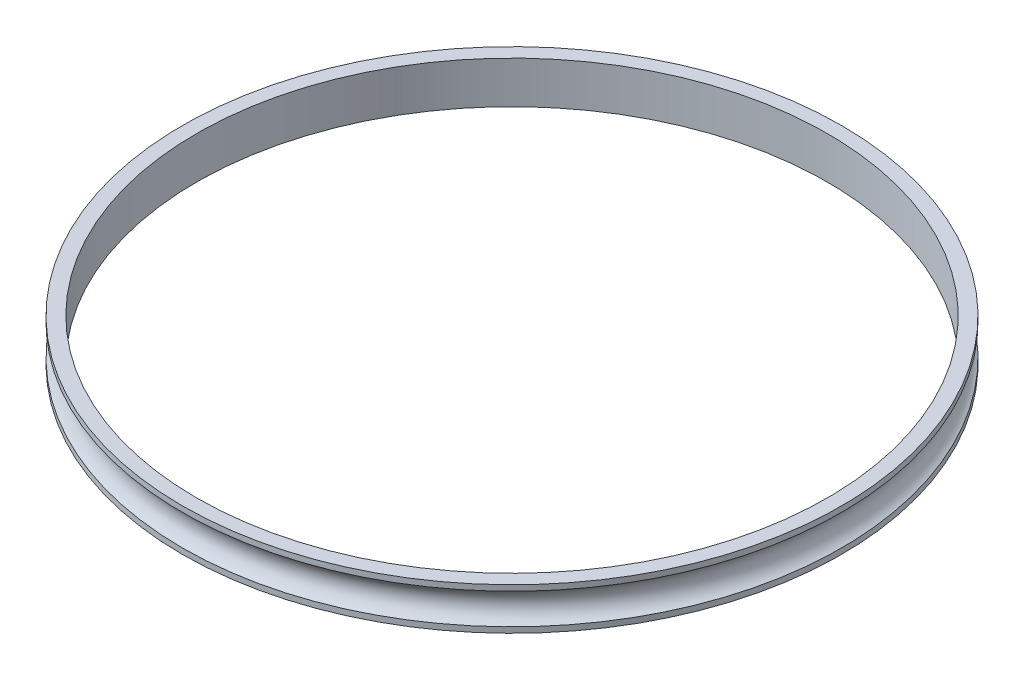
ISO-10303-21;
HEADER;
FILE_DESCRIPTION(('STEP AP214'),'2;1');
FILE_NAME('part.step','',(''),(''),'','','');
FILE_SCHEMA(('AUTOMOTIVE_DESIGN { 1 0 10303 214 1 1 1 1 }'));
ENDSEC;
DATA;
#1=APPLICATION_CONTEXT('core data for automotive mechanical design processes');
#2=APPLICATION_PROTOCOL_DEFINITION('international standard','automotive_design',2000,#1);
#3=PRODUCT_CONTEXT('',#1,'mechanical');
#4=PRODUCT('Part','Part','',(#3));
#5=PRODUCT_RELATED_PRODUCT_CATEGORY('part','',(#4));
#6=PRODUCT_DEFINITION_FORMATION('','',#4);
#7=PRODUCT_DEFINITION_CONTEXT('part definition',#1,'design');
#8=PRODUCT_DEFINITION('design','',#6,#7);
#9=PRODUCT_DEFINITION_SHAPE('','',#8);
#10=(LENGTH_UNIT() NAMED_UNIT(*) SI_UNIT(.MILLI.,.METRE.));
#11=(NAMED_UNIT(*) PLANE_ANGLE_UNIT() SI_UNIT($,.RADIAN.));
#12=(NAMED_UNIT(*) SI_UNIT($,.STERADIAN.) SOLID_ANGLE_UNIT());
#13=UNCERTAINTY_MEASURE_WITH_UNIT(LENGTH_MEASURE(1.E-05),#10,'distance_accuracy_value','');
#14=(GEOMETRIC_REPRESENTATION_CONTEXT(3) GLOBAL_UNCERTAINTY_ASSIGNED_CONTEXT((#13)) GLOBAL_UNIT_ASSIGNED_CONTEXT((#10,
#11,#12)) REPRESENTATION_CONTEXT('',''));
#15=CARTESIAN_POINT('',(0.,0.,0.));
#16=DIRECTION('',(0.,0.,1.));
#17=DIRECTION('',(1.,0.,0.));
#18=AXIS2_PLACEMENT_3D('',#15,#16,#17);
#19=CARTESIAN_POINT('',(0.,6.,0.));
#20=DIRECTION('',(0.,-1.,0.));
#21=DIRECTION('',(0.,0.,-1.));
#22=AXIS2_PLACEMENT_3D('',#19,#20,#21);
#23=CYLINDRICAL_SURFACE('',#22,47.);
#24=CARTESIAN_POINT('',(0.,0.,0.));
#25=DIRECTION('',(0.,1.,0.));
#26=DIRECTION('',(0.,0.,1.));
#27=AXIS2_PLACEMENT_3D('',#24,#25,#26);
#28=CIRCLE('',#27,47.);
#29=CARTESIAN_POINT('',(0.,0.,47.));
#30=VERTEX_POINT('',#29);
#31=EDGE_CURVE('E49',#30,#30,#28,.T.);
#32=ORIENTED_EDGE('',*,*,#31,.T.);
#33=EDGE_LOOP('',(#32));
#34=FACE_BOUND('',#33,.T.);
#35=CARTESIAN_POINT('',(0.,0.806828780053866,0.));
#36=DIRECTION('',(0.,1.,0.));
#37=DIRECTION('',(0.,0.,1.));
#38=AXIS2_PLACEMENT_3D('',#35,#36,#37);
#39=CIRCLE('',#38,47.);
#40=CARTESIAN_POINT('',(0.,0.806828780053866,47.));
#41=VERTEX_POINT('',#40);
#42=EDGE_CURVE('E46',#41,#41,#39,.T.);
#43=ORIENTED_EDGE('',*,*,#42,.F.);
#44=EDGE_LOOP('',(#43));
#45=FACE_BOUND('',#44,.T.);
#46=ADVANCED_FACE('F43',(#34,#45),#23,.T.);
#47=CARTESIAN_POINT('',(0.,6.,0.));
#48=DIRECTION('',(0.,1.,0.));
#49=DIRECTION('',(0.,0.,1.));
#50=AXIS2_PLACEMENT_3D('',#47,#48,#49);
#51=CIRCLE('',#50,47.);
#52=CARTESIAN_POINT('',(0.,6.,47.));
#53=VERTEX_POINT('',#52);
#54=EDGE_CURVE('E11',#53,#53,#51,.T.);
#55=ORIENTED_EDGE('',*,*,#54,.F.);
#56=EDGE_LOOP('',(#55));
#57=FACE_BOUND('',#56,.T.);
#58=CARTESIAN_POINT('',(0.,5.19317121994613,0.));
#59=DIRECTION('',(0.,-1.,0.));
#60=DIRECTION('',(0.,0.,-1.));
#61=AXIS2_PLACEMENT_3D('',#58,#59,#60);
#62=CIRCLE('',#61,47.);
#63=CARTESIAN_POINT('',(0.,5.19317121994613,-47.));
#64=VERTEX_POINT('',#63);
#65=EDGE_CURVE('E58',#64,#64,#62,.T.);
#66=ORIENTED_EDGE('',*,*,#65,.F.);
#67=EDGE_LOOP('',(#66));
#68=FACE_BOUND('',#67,.T.);
#69=ADVANCED_FACE('F79',(#57,#68),#23,.T.);
#70=CARTESIAN_POINT('',(0.,6.,0.));
#71=DIRECTION('',(0.,1.,0.));
#72=DIRECTION('',(0.,0.,1.));
#73=AXIS2_PLACEMENT_3D('',#70,#71,#72);
#74=PLANE('',#73);
#75=ORIENTED_EDGE('',*,*,#54,.T.);
#76=EDGE_LOOP('',(#75));
#77=FACE_BOUND('',#76,.T.);
#78=CARTESIAN_POINT('',(0.,6.,0.));
#79=DIRECTION('',(0.,1.,0.));
#80=DIRECTION('',(0.,0.,1.));
#81=AXIS2_PLACEMENT_3D('',#78,#79,#80);
#82=CIRCLE('',#81,45.);
#83=CARTESIAN_POINT('',(0.,6.,45.));
#84=VERTEX_POINT('',#83);
#85=EDGE_CURVE('E54',#84,#84,#82,.T.);
#86=ORIENTED_EDGE('',*,*,#85,.F.);
#87=EDGE_LOOP('',(#86));
#88=FACE_BOUND('',#87,.T.);
#89=ADVANCED_FACE('F77',(#77,#88),#74,.T.);
#90=CARTESIAN_POINT('',(0.,0.,0.));
#91=DIRECTION('',(0.,1.,0.));
#92=DIRECTION('',(0.,0.,1.));
#93=AXIS2_PLACEMENT_3D('',#90,#91,#92);
#94=PLANE('',#93);
#95=ORIENTED_EDGE('',*,*,#31,.F.);
#96=EDGE_LOOP('',(#95));
#97=FACE_BOUND('',#96,.T.);
#98=CARTESIAN_POINT('',(0.,0.,0.));
#99=DIRECTION('',(0.,1.,0.));
#100=DIRECTION('',(0.,0.,1.));
#101=AXIS2_PLACEMENT_3D('',#98,#99,#100);
#102=CIRCLE('',#101,45.);
#103=CARTESIAN_POINT('',(0.,0.,45.));
#104=VERTEX_POINT('',#103);
#105=EDGE_CURVE('E59',#104,#104,#102,.T.);
#106=ORIENTED_EDGE('',*,*,#105,.T.);
#107=EDGE_LOOP('',(#106));
#108=FACE_BOUND('',#107,.T.);
#109=ADVANCED_FACE('F76',(#97,#108),#94,.F.);
#110=CARTESIAN_POINT('',(0.,6.,0.));
#111=DIRECTION('',(0.,-1.,0.));
#112=DIRECTION('',(0.,0.,-1.));
#113=AXIS2_PLACEMENT_3D('',#110,#111,#112);
#114=CYLINDRICAL_SURFACE('',#113,45.);
#115=ORIENTED_EDGE('',*,*,#85,.T.);
#116=EDGE_LOOP('',(#115));
#117=FACE_BOUND('',#116,.T.);
#118=ORIENTED_EDGE('',*,*,#105,.F.);
#119=EDGE_LOOP('',(#118));
#120=FACE_BOUND('',#119,.T.);
#121=ADVANCED_FACE('F75',(#117,#120),#114,.F.);
#122=CARTESIAN_POINT('',(0.,3.,0.));
#123=DIRECTION('',(0.,-1.,0.));
#124=DIRECTION('',(0.,0.,-1.));
#125=AXIS2_PLACEMENT_3D('',#122,#123,#124);
#126=TOROIDAL_SURFACE('',#125,48.2,2.5);
#127=ORIENTED_EDGE('',*,*,#65,.T.);
#128=EDGE_LOOP('',(#127));
#129=FACE_BOUND('',#128,.T.);
#130=ORIENTED_EDGE('',*,*,#42,.T.);
#131=EDGE_LOOP('',(#130));
#132=FACE_BOUND('',#131,.T.);
#133=ADVANCED_FACE('F106',(#129,#132),#126,.F.);
#134=CLOSED_SHELL('',(#46,#69,#89,#109,#121,#133));
#135=MANIFOLD_SOLID_BREP('B2',#134);
#136=ADVANCED_BREP_SHAPE_REPRESENTATION('',(#18,#135),#14);
#137=SHAPE_DEFINITION_REPRESENTATION(#9,#136);
ENDSEC;
END-ISO-10303-21;
